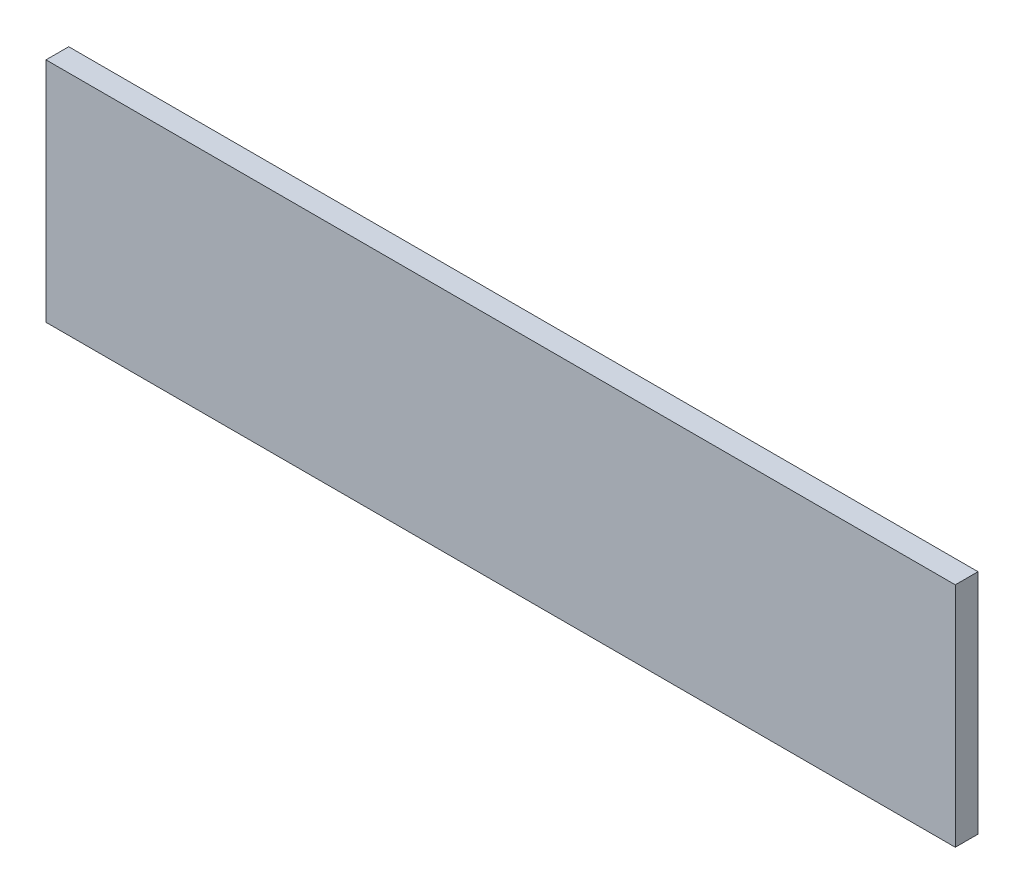
ISO-10303-21;
HEADER;
FILE_DESCRIPTION(('STEP AP214'),'2;1');
FILE_NAME('part.step','',(''),(''),'','','');
FILE_SCHEMA(('AUTOMOTIVE_DESIGN { 1 0 10303 214 1 1 1 1 }'));
ENDSEC;
DATA;
#1=APPLICATION_CONTEXT('core data for automotive mechanical design processes');
#2=APPLICATION_PROTOCOL_DEFINITION('international standard','automotive_design',2000,#1);
#3=PRODUCT_CONTEXT('',#1,'mechanical');
#4=PRODUCT('Part','Part','',(#3));
#5=PRODUCT_RELATED_PRODUCT_CATEGORY('part','',(#4));
#6=PRODUCT_DEFINITION_FORMATION('','',#4);
#7=PRODUCT_DEFINITION_CONTEXT('part definition',#1,'design');
#8=PRODUCT_DEFINITION('design','',#6,#7);
#9=PRODUCT_DEFINITION_SHAPE('','',#8);
#10=(LENGTH_UNIT() NAMED_UNIT(*) SI_UNIT(.MILLI.,.METRE.));
#11=(NAMED_UNIT(*) PLANE_ANGLE_UNIT() SI_UNIT($,.RADIAN.));
#12=(NAMED_UNIT(*) SI_UNIT($,.STERADIAN.) SOLID_ANGLE_UNIT());
#13=UNCERTAINTY_MEASURE_WITH_UNIT(LENGTH_MEASURE(1.E-05),#10,'distance_accuracy_value','');
#14=(GEOMETRIC_REPRESENTATION_CONTEXT(3) GLOBAL_UNCERTAINTY_ASSIGNED_CONTEXT((#13)) GLOBAL_UNIT_ASSIGNED_CONTEXT((#10,
#11,#12)) REPRESENTATION_CONTEXT('',''));
#15=CARTESIAN_POINT('',(0.,0.,0.));
#16=DIRECTION('',(0.,0.,1.));
#17=DIRECTION('',(1.,0.,0.));
#18=AXIS2_PLACEMENT_3D('',#15,#16,#17);
#19=CARTESIAN_POINT('',(-200.,50.,10.));
#20=DIRECTION('',(1.,0.,0.));
#21=DIRECTION('',(0.,0.,-1.));
#22=AXIS2_PLACEMENT_3D('',#19,#20,#21);
#23=PLANE('',#22);
#24=DIRECTION('',(0.,-1.,0.));
#25=VECTOR('',#24,1.);
#26=CARTESIAN_POINT('',(-200.,50.,0.));
#27=LINE('',#26,#25);
#28=CARTESIAN_POINT('',(-200.,50.,0.));
#29=VERTEX_POINT('',#28);
#30=CARTESIAN_POINT('',(-200.,-50.,0.));
#31=VERTEX_POINT('',#30);
#32=EDGE_CURVE('E99',#29,#31,#27,.T.);
#33=ORIENTED_EDGE('',*,*,#32,.T.);
#34=DIRECTION('',(0.,0.,-1.));
#35=VECTOR('',#34,1.);
#36=CARTESIAN_POINT('',(-200.,-50.,10.));
#37=LINE('',#36,#35);
#38=CARTESIAN_POINT('',(-200.,-50.,10.));
#39=VERTEX_POINT('',#38);
#40=EDGE_CURVE('E11',#39,#31,#37,.T.);
#41=ORIENTED_EDGE('',*,*,#40,.F.);
#42=DIRECTION('',(0.,-1.,0.));
#43=VECTOR('',#42,1.);
#44=CARTESIAN_POINT('',(-200.,50.,10.));
#45=LINE('',#44,#43);
#46=CARTESIAN_POINT('',(-200.,50.,10.));
#47=VERTEX_POINT('',#46);
#48=EDGE_CURVE('E87',#47,#39,#45,.T.);
#49=ORIENTED_EDGE('',*,*,#48,.F.);
#50=DIRECTION('',(0.,0.,-1.));
#51=VECTOR('',#50,1.);
#52=CARTESIAN_POINT('',(-200.,50.,10.));
#53=LINE('',#52,#51);
#54=EDGE_CURVE('E95',#47,#29,#53,.T.);
#55=ORIENTED_EDGE('',*,*,#54,.T.);
#56=EDGE_LOOP('',(#33,#41,#49,#55));
#57=FACE_BOUND('',#56,.T.);
#58=ADVANCED_FACE('F36',(#57),#23,.F.);
#59=CARTESIAN_POINT('',(-200.,-50.,10.));
#60=DIRECTION('',(0.,1.,0.));
#61=DIRECTION('',(0.,0.,1.));
#62=AXIS2_PLACEMENT_3D('',#59,#60,#61);
#63=PLANE('',#62);
#64=DIRECTION('',(1.,0.,0.));
#65=VECTOR('',#64,1.);
#66=CARTESIAN_POINT('',(-200.,-50.,0.));
#67=LINE('',#66,#65);
#68=CARTESIAN_POINT('',(200.,-50.,0.));
#69=VERTEX_POINT('',#68);
#70=EDGE_CURVE('E91',#31,#69,#67,.T.);
#71=ORIENTED_EDGE('',*,*,#70,.T.);
#72=DIRECTION('',(0.,0.,-1.));
#73=VECTOR('',#72,1.);
#74=CARTESIAN_POINT('',(200.,-50.,10.));
#75=LINE('',#74,#73);
#76=CARTESIAN_POINT('',(200.,-50.,10.));
#77=VERTEX_POINT('',#76);
#78=EDGE_CURVE('E44',#77,#69,#75,.T.);
#79=ORIENTED_EDGE('',*,*,#78,.F.);
#80=DIRECTION('',(1.,0.,0.));
#81=VECTOR('',#80,1.);
#82=CARTESIAN_POINT('',(-200.,-50.,10.));
#83=LINE('',#82,#81);
#84=EDGE_CURVE('E82',#39,#77,#83,.T.);
#85=ORIENTED_EDGE('',*,*,#84,.F.);
#86=ORIENTED_EDGE('',*,*,#40,.T.);
#87=EDGE_LOOP('',(#71,#79,#85,#86));
#88=FACE_BOUND('',#87,.T.);
#89=ADVANCED_FACE('F90',(#88),#63,.F.);
#90=CARTESIAN_POINT('',(200.,50.,10.));
#91=DIRECTION('',(-1.,0.,0.));
#92=DIRECTION('',(0.,0.,1.));
#93=AXIS2_PLACEMENT_3D('',#90,#91,#92);
#94=PLANE('',#93);
#95=DIRECTION('',(0.,1.,0.));
#96=VECTOR('',#95,1.);
#97=CARTESIAN_POINT('',(200.,50.,0.));
#98=LINE('',#97,#96);
#99=CARTESIAN_POINT('',(200.,50.,0.));
#100=VERTEX_POINT('',#99);
#101=EDGE_CURVE('E69',#69,#100,#98,.T.);
#102=ORIENTED_EDGE('',*,*,#101,.T.);
#103=DIRECTION('',(0.,0.,-1.));
#104=VECTOR('',#103,1.);
#105=CARTESIAN_POINT('',(200.,50.,10.));
#106=LINE('',#105,#104);
#107=CARTESIAN_POINT('',(200.,50.,10.));
#108=VERTEX_POINT('',#107);
#109=EDGE_CURVE('E92',#108,#100,#106,.T.);
#110=ORIENTED_EDGE('',*,*,#109,.F.);
#111=DIRECTION('',(0.,1.,0.));
#112=VECTOR('',#111,1.);
#113=CARTESIAN_POINT('',(200.,50.,10.));
#114=LINE('',#113,#112);
#115=EDGE_CURVE('E85',#77,#108,#114,.T.);
#116=ORIENTED_EDGE('',*,*,#115,.F.);
#117=ORIENTED_EDGE('',*,*,#78,.T.);
#118=EDGE_LOOP('',(#102,#110,#116,#117));
#119=FACE_BOUND('',#118,.T.);
#120=ADVANCED_FACE('F93',(#119),#94,.F.);
#121=CARTESIAN_POINT('',(-200.,50.,10.));
#122=DIRECTION('',(0.,-1.,0.));
#123=DIRECTION('',(0.,0.,-1.));
#124=AXIS2_PLACEMENT_3D('',#121,#122,#123);
#125=PLANE('',#124);
#126=DIRECTION('',(-1.,0.,0.));
#127=VECTOR('',#126,1.);
#128=CARTESIAN_POINT('',(-200.,50.,0.));
#129=LINE('',#128,#127);
#130=EDGE_CURVE('E75',#100,#29,#129,.T.);
#131=ORIENTED_EDGE('',*,*,#130,.T.);
#132=ORIENTED_EDGE('',*,*,#54,.F.);
#133=DIRECTION('',(-1.,0.,0.));
#134=VECTOR('',#133,1.);
#135=CARTESIAN_POINT('',(-200.,50.,10.));
#136=LINE('',#135,#134);
#137=EDGE_CURVE('E52',#108,#47,#136,.T.);
#138=ORIENTED_EDGE('',*,*,#137,.F.);
#139=ORIENTED_EDGE('',*,*,#109,.T.);
#140=EDGE_LOOP('',(#131,#132,#138,#139));
#141=FACE_BOUND('',#140,.T.);
#142=ADVANCED_FACE('F107',(#141),#125,.F.);
#143=CARTESIAN_POINT('',(0.,0.,10.));
#144=DIRECTION('',(0.,0.,1.));
#145=DIRECTION('',(1.,0.,0.));
#146=AXIS2_PLACEMENT_3D('',#143,#144,#145);
#147=PLANE('',#146);
#148=ORIENTED_EDGE('',*,*,#48,.T.);
#149=ORIENTED_EDGE('',*,*,#84,.T.);
#150=ORIENTED_EDGE('',*,*,#115,.T.);
#151=ORIENTED_EDGE('',*,*,#137,.T.);
#152=EDGE_LOOP('',(#148,#149,#150,#151));
#153=FACE_BOUND('',#152,.T.);
#154=ADVANCED_FACE('F83',(#153),#147,.T.);
#155=CARTESIAN_POINT('',(0.,0.,0.));
#156=DIRECTION('',(0.,0.,1.));
#157=DIRECTION('',(1.,0.,0.));
#158=AXIS2_PLACEMENT_3D('',#155,#156,#157);
#159=PLANE('',#158);
#160=CARTESIAN_POINT('',(0.,0.,0.));
#161=DIRECTION('',(0.,0.,-1.));
#162=DIRECTION('',(-1.,0.,0.));
#163=AXIS2_PLACEMENT_3D('',#160,#161,#162);
#164=CIRCLE('',#163,20.);
#165=CARTESIAN_POINT('',(-20.,0.,0.));
#166=VERTEX_POINT('',#165);
#167=EDGE_CURVE('E113',#166,#166,#164,.T.);
#168=ORIENTED_EDGE('',*,*,#167,.F.);
#169=EDGE_LOOP('',(#168));
#170=FACE_BOUND('',#169,.T.);
#171=ORIENTED_EDGE('',*,*,#32,.F.);
#172=ORIENTED_EDGE('',*,*,#130,.F.);
#173=ORIENTED_EDGE('',*,*,#101,.F.);
#174=ORIENTED_EDGE('',*,*,#70,.F.);
#175=EDGE_LOOP('',(#171,#172,#173,#174));
#176=FACE_BOUND('',#175,.T.);
#177=ADVANCED_FACE('F110',(#170,#176),#159,.F.);
#178=CARTESIAN_POINT('',(0.,0.,0.5));
#179=DIRECTION('',(0.,0.,-1.));
#180=DIRECTION('',(-1.,0.,0.));
#181=AXIS2_PLACEMENT_3D('',#178,#179,#180);
#182=CYLINDRICAL_SURFACE('',#181,20.);
#183=CARTESIAN_POINT('',(0.,0.,0.5));
#184=DIRECTION('',(0.,0.,-1.));
#185=DIRECTION('',(-1.,0.,0.));
#186=AXIS2_PLACEMENT_3D('',#183,#184,#185);
#187=CIRCLE('',#186,20.);
#188=CARTESIAN_POINT('',(-20.,0.,0.5));
#189=VERTEX_POINT('',#188);
#190=EDGE_CURVE('E102',#189,#189,#187,.T.);
#191=ORIENTED_EDGE('',*,*,#190,.F.);
#192=EDGE_LOOP('',(#191));
#193=FACE_BOUND('',#192,.T.);
#194=ORIENTED_EDGE('',*,*,#167,.T.);
#195=EDGE_LOOP('',(#194));
#196=FACE_BOUND('',#195,.T.);
#197=ADVANCED_FACE('F121',(#193,#196),#182,.F.);
#198=CARTESIAN_POINT('',(0.,0.,0.5));
#199=DIRECTION('',(0.,0.,-1.));
#200=DIRECTION('',(-1.,0.,0.));
#201=AXIS2_PLACEMENT_3D('',#198,#199,#200);
#202=PLANE('',#201);
#203=ORIENTED_EDGE('',*,*,#190,.T.);
#204=EDGE_LOOP('',(#203));
#205=FACE_BOUND('',#204,.T.);
#206=ADVANCED_FACE('F119',(#205),#202,.T.);
#207=CLOSED_SHELL('',(#58,#89,#120,#142,#154,#177,#197,#206));
#208=MANIFOLD_SOLID_BREP('B2',#207);
#209=ADVANCED_BREP_SHAPE_REPRESENTATION('',(#18,#208),#14);
#210=SHAPE_DEFINITION_REPRESENTATION(#9,#209);
ENDSEC;
END-ISO-10303-21;
